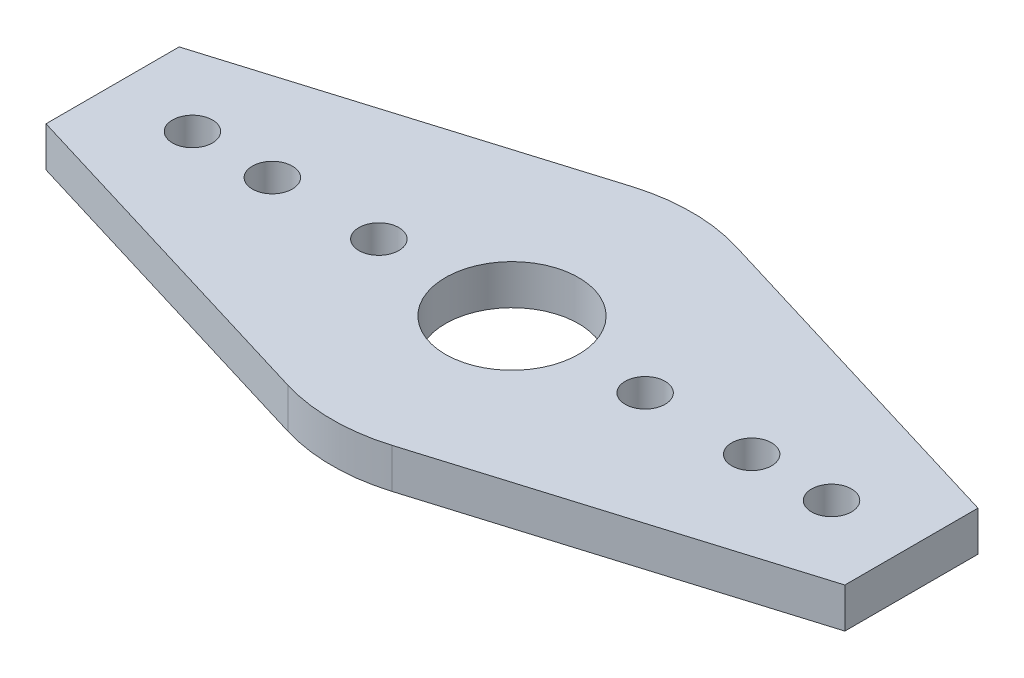
ISO-10303-21;
HEADER;
FILE_DESCRIPTION(('STEP AP214'),'2;1');
FILE_NAME('part.step','',(''),(''),'','','');
FILE_SCHEMA(('AUTOMOTIVE_DESIGN { 1 0 10303 214 1 1 1 1 }'));
ENDSEC;
DATA;
#1=APPLICATION_CONTEXT('core data for automotive mechanical design processes');
#2=APPLICATION_PROTOCOL_DEFINITION('international standard','automotive_design',2000,#1);
#3=PRODUCT_CONTEXT('',#1,'mechanical');
#4=PRODUCT('Part','Part','',(#3));
#5=PRODUCT_RELATED_PRODUCT_CATEGORY('part','',(#4));
#6=PRODUCT_DEFINITION_FORMATION('','',#4);
#7=PRODUCT_DEFINITION_CONTEXT('part definition',#1,'design');
#8=PRODUCT_DEFINITION('design','',#6,#7);
#9=PRODUCT_DEFINITION_SHAPE('','',#8);
#10=(LENGTH_UNIT() NAMED_UNIT(*) SI_UNIT(.MILLI.,.METRE.));
#11=(NAMED_UNIT(*) PLANE_ANGLE_UNIT() SI_UNIT($,.RADIAN.));
#12=(NAMED_UNIT(*) SI_UNIT($,.STERADIAN.) SOLID_ANGLE_UNIT());
#13=UNCERTAINTY_MEASURE_WITH_UNIT(LENGTH_MEASURE(1.E-05),#10,'distance_accuracy_value','');
#14=(GEOMETRIC_REPRESENTATION_CONTEXT(3) GLOBAL_UNCERTAINTY_ASSIGNED_CONTEXT((#13)) GLOBAL_UNIT_ASSIGNED_CONTEXT((#10,
#11,#12)) REPRESENTATION_CONTEXT('',''));
#15=CARTESIAN_POINT('',(0.,0.,0.));
#16=DIRECTION('',(0.,0.,1.));
#17=DIRECTION('',(1.,0.,0.));
#18=AXIS2_PLACEMENT_3D('',#15,#16,#17);
#19=CARTESIAN_POINT('',(-0.169164408184982,3.,-0.557162952153057));
#20=DIRECTION('',(-0.29052194513609,0.,-0.956868329183458));
#21=DIRECTION('',(-0.956868329183458,0.,0.29052194513609));
#22=AXIS2_PLACEMENT_3D('',#19,#20,#21);
#23=PLANE('',#22);
#24=DIRECTION('',(0.956868329183458,0.,-0.29052194513609));
#25=VECTOR('',#24,1.);
#26=CARTESIAN_POINT('',(-0.169164408184982,0.,-0.557162952153057));
#27=LINE('',#26,#25);
#28=CARTESIAN_POINT('',(-30.,0.,8.5));
#29=VERTEX_POINT('',#28);
#30=CARTESIAN_POINT('',(-3.92204625933722,0.,0.582277556023319));
#31=VERTEX_POINT('',#30);
#32=EDGE_CURVE('E158',#29,#31,#27,.T.);
#33=ORIENTED_EDGE('',*,*,#32,.F.);
#34=DIRECTION('',(0.,-1.,0.));
#35=VECTOR('',#34,1.);
#36=CARTESIAN_POINT('',(-30.,3.,8.5));
#37=LINE('',#36,#35);
#38=CARTESIAN_POINT('',(-30.,3.,8.5));
#39=VERTEX_POINT('',#38);
#40=EDGE_CURVE('E11',#39,#29,#37,.T.);
#41=ORIENTED_EDGE('',*,*,#40,.F.);
#42=DIRECTION('',(0.956868329183458,0.,-0.29052194513609));
#43=VECTOR('',#42,1.);
#44=CARTESIAN_POINT('',(-0.169164408184982,3.,-0.557162952153057));
#45=LINE('',#44,#43);
#46=CARTESIAN_POINT('',(-3.92204625933722,3.,0.582277556023319));
#47=VERTEX_POINT('',#46);
#48=EDGE_CURVE('E271',#39,#47,#45,.T.);
#49=ORIENTED_EDGE('',*,*,#48,.T.);
#50=DIRECTION('',(0.,-1.,0.));
#51=VECTOR('',#50,1.);
#52=CARTESIAN_POINT('',(-3.92204625933722,3.,0.582277556023319));
#53=LINE('',#52,#51);
#54=EDGE_CURVE('E86',#47,#31,#53,.T.);
#55=ORIENTED_EDGE('',*,*,#54,.T.);
#56=EDGE_LOOP('',(#33,#41,#49,#55));
#57=FACE_BOUND('',#56,.T.);
#58=ADVANCED_FACE('F35',(#57),#23,.T.);
#59=CARTESIAN_POINT('',(-30.,3.,0.));
#60=DIRECTION('',(-1.,0.,0.));
#61=DIRECTION('',(0.,0.,1.));
#62=AXIS2_PLACEMENT_3D('',#59,#60,#61);
#63=PLANE('',#62);
#64=DIRECTION('',(0.,0.,-1.));
#65=VECTOR('',#64,1.);
#66=CARTESIAN_POINT('',(-30.,0.,0.));
#67=LINE('',#66,#65);
#68=CARTESIAN_POINT('',(-30.,0.,18.5));
#69=VERTEX_POINT('',#68);
#70=EDGE_CURVE('E152',#69,#29,#67,.T.);
#71=ORIENTED_EDGE('',*,*,#70,.F.);
#72=DIRECTION('',(0.,-1.,0.));
#73=VECTOR('',#72,1.);
#74=CARTESIAN_POINT('',(-30.,3.,18.5));
#75=LINE('',#74,#73);
#76=CARTESIAN_POINT('',(-30.,3.,18.5));
#77=VERTEX_POINT('',#76);
#78=EDGE_CURVE('E44',#77,#69,#75,.T.);
#79=ORIENTED_EDGE('',*,*,#78,.F.);
#80=DIRECTION('',(0.,0.,-1.));
#81=VECTOR('',#80,1.);
#82=CARTESIAN_POINT('',(-30.,3.,0.));
#83=LINE('',#82,#81);
#84=EDGE_CURVE('E273',#77,#39,#83,.T.);
#85=ORIENTED_EDGE('',*,*,#84,.T.);
#86=ORIENTED_EDGE('',*,*,#40,.T.);
#87=EDGE_LOOP('',(#71,#79,#85,#86));
#88=FACE_BOUND('',#87,.T.);
#89=ADVANCED_FACE('F157',(#88),#63,.T.);
#90=CARTESIAN_POINT('',(-7.67492811048945,3.,25.2782819358003));
#91=DIRECTION('',(0.29052194513609,0.,-0.956868329183458));
#92=DIRECTION('',(-0.956868329183458,0.,-0.29052194513609));
#93=AXIS2_PLACEMENT_3D('',#90,#91,#92);
#94=PLANE('',#93);
#95=DIRECTION('',(0.956868329183458,0.,0.29052194513609));
#96=VECTOR('',#95,1.);
#97=CARTESIAN_POINT('',(-7.67492811048945,0.,25.2782819358003));
#98=LINE('',#97,#96);
#99=CARTESIAN_POINT('',(-3.92204625933722,0.,26.4177224439767));
#100=VERTEX_POINT('',#99);
#101=EDGE_CURVE('E142',#69,#100,#98,.T.);
#102=ORIENTED_EDGE('',*,*,#101,.T.);
#103=DIRECTION('',(0.,-1.,0.));
#104=VECTOR('',#103,1.);
#105=CARTESIAN_POINT('',(-3.92204625933722,3.,26.4177224439767));
#106=LINE('',#105,#104);
#107=CARTESIAN_POINT('',(-3.92204625933722,3.,26.4177224439767));
#108=VERTEX_POINT('',#107);
#109=EDGE_CURVE('E134',#108,#100,#106,.T.);
#110=ORIENTED_EDGE('',*,*,#109,.F.);
#111=DIRECTION('',(0.956868329183458,0.,0.29052194513609));
#112=VECTOR('',#111,1.);
#113=CARTESIAN_POINT('',(-7.67492811048945,3.,25.2782819358003));
#114=LINE('',#113,#112);
#115=EDGE_CURVE('E144',#77,#108,#114,.T.);
#116=ORIENTED_EDGE('',*,*,#115,.F.);
#117=ORIENTED_EDGE('',*,*,#78,.T.);
#118=EDGE_LOOP('',(#102,#110,#116,#117));
#119=FACE_BOUND('',#118,.T.);
#120=ADVANCED_FACE('F140',(#119),#94,.F.);
#121=CARTESIAN_POINT('',(0.,3.,13.5));
#122=DIRECTION('',(0.,-1.,0.));
#123=DIRECTION('',(0.,0.,-1.));
#124=AXIS2_PLACEMENT_3D('',#121,#122,#123);
#125=CYLINDRICAL_SURFACE('',#124,13.5);
#126=CARTESIAN_POINT('',(0.,0.,13.5));
#127=DIRECTION('',(0.,1.,0.));
#128=DIRECTION('',(0.,0.,1.));
#129=AXIS2_PLACEMENT_3D('',#126,#127,#128);
#130=CIRCLE('',#129,13.5);
#131=CARTESIAN_POINT('',(3.92204625933722,0.,26.4177224439767));
#132=VERTEX_POINT('',#131);
#133=EDGE_CURVE('E155',#100,#132,#130,.T.);
#134=ORIENTED_EDGE('',*,*,#133,.T.);
#135=DIRECTION('',(0.,-1.,0.));
#136=VECTOR('',#135,1.);
#137=CARTESIAN_POINT('',(3.92204625933722,3.,26.4177224439767));
#138=LINE('',#137,#136);
#139=CARTESIAN_POINT('',(3.92204625933722,3.,26.4177224439767));
#140=VERTEX_POINT('',#139);
#141=EDGE_CURVE('E128',#140,#132,#138,.T.);
#142=ORIENTED_EDGE('',*,*,#141,.F.);
#143=CARTESIAN_POINT('',(0.,3.,13.5));
#144=DIRECTION('',(0.,1.,0.));
#145=DIRECTION('',(0.,0.,1.));
#146=AXIS2_PLACEMENT_3D('',#143,#144,#145);
#147=CIRCLE('',#146,13.5);
#148=EDGE_CURVE('E280',#108,#140,#147,.T.);
#149=ORIENTED_EDGE('',*,*,#148,.F.);
#150=ORIENTED_EDGE('',*,*,#109,.T.);
#151=EDGE_LOOP('',(#134,#142,#149,#150));
#152=FACE_BOUND('',#151,.T.);
#153=ADVANCED_FACE('F229',(#152),#125,.T.);
#154=CARTESIAN_POINT('',(7.67492811048946,3.,25.2782819358003));
#155=DIRECTION('',(0.290521945136091,0.,0.956868329183458));
#156=DIRECTION('',(0.956868329183458,0.,-0.290521945136091));
#157=AXIS2_PLACEMENT_3D('',#154,#155,#156);
#158=PLANE('',#157);
#159=DIRECTION('',(-0.956868329183458,0.,0.290521945136091));
#160=VECTOR('',#159,1.);
#161=CARTESIAN_POINT('',(7.67492811048946,0.,25.2782819358003));
#162=LINE('',#161,#160);
#163=CARTESIAN_POINT('',(30.,0.,18.5));
#164=VERTEX_POINT('',#163);
#165=EDGE_CURVE('E165',#164,#132,#162,.T.);
#166=ORIENTED_EDGE('',*,*,#165,.F.);
#167=DIRECTION('',(0.,-1.,0.));
#168=VECTOR('',#167,1.);
#169=CARTESIAN_POINT('',(30.,3.,18.5));
#170=LINE('',#169,#168);
#171=CARTESIAN_POINT('',(30.,3.,18.5));
#172=VERTEX_POINT('',#171);
#173=EDGE_CURVE('E126',#172,#164,#170,.T.);
#174=ORIENTED_EDGE('',*,*,#173,.F.);
#175=DIRECTION('',(-0.956868329183458,0.,0.290521945136091));
#176=VECTOR('',#175,1.);
#177=CARTESIAN_POINT('',(7.67492811048946,3.,25.2782819358003));
#178=LINE('',#177,#176);
#179=EDGE_CURVE('E120',#172,#140,#178,.T.);
#180=ORIENTED_EDGE('',*,*,#179,.T.);
#181=ORIENTED_EDGE('',*,*,#141,.T.);
#182=EDGE_LOOP('',(#166,#174,#180,#181));
#183=FACE_BOUND('',#182,.T.);
#184=ADVANCED_FACE('F232',(#183),#158,.T.);
#185=CARTESIAN_POINT('',(30.,3.,0.));
#186=DIRECTION('',(-1.,0.,0.));
#187=DIRECTION('',(0.,0.,1.));
#188=AXIS2_PLACEMENT_3D('',#185,#186,#187);
#189=PLANE('',#188);
#190=DIRECTION('',(0.,0.,-1.));
#191=VECTOR('',#190,1.);
#192=CARTESIAN_POINT('',(30.,0.,0.));
#193=LINE('',#192,#191);
#194=CARTESIAN_POINT('',(30.,0.,8.49999999999999));
#195=VERTEX_POINT('',#194);
#196=EDGE_CURVE('E125',#164,#195,#193,.T.);
#197=ORIENTED_EDGE('',*,*,#196,.T.);
#198=DIRECTION('',(0.,-1.,0.));
#199=VECTOR('',#198,1.);
#200=CARTESIAN_POINT('',(30.,3.,8.49999999999999));
#201=LINE('',#200,#199);
#202=CARTESIAN_POINT('',(30.,3.,8.49999999999999));
#203=VERTEX_POINT('',#202);
#204=EDGE_CURVE('E110',#203,#195,#201,.T.);
#205=ORIENTED_EDGE('',*,*,#204,.F.);
#206=DIRECTION('',(0.,0.,-1.));
#207=VECTOR('',#206,1.);
#208=CARTESIAN_POINT('',(30.,3.,0.));
#209=LINE('',#208,#207);
#210=EDGE_CURVE('E113',#172,#203,#209,.T.);
#211=ORIENTED_EDGE('',*,*,#210,.F.);
#212=ORIENTED_EDGE('',*,*,#173,.T.);
#213=EDGE_LOOP('',(#197,#205,#211,#212));
#214=FACE_BOUND('',#213,.T.);
#215=ADVANCED_FACE('F123',(#214),#189,.F.);
#216=CARTESIAN_POINT('',(0.169164408184981,3.,-0.557162952153054));
#217=DIRECTION('',(-0.29052194513609,0.,0.956868329183458));
#218=DIRECTION('',(0.956868329183458,0.,0.29052194513609));
#219=AXIS2_PLACEMENT_3D('',#216,#217,#218);
#220=PLANE('',#219);
#221=DIRECTION('',(-0.956868329183458,0.,-0.29052194513609));
#222=VECTOR('',#221,1.);
#223=CARTESIAN_POINT('',(0.169164408184981,0.,-0.557162952153054));
#224=LINE('',#223,#222);
#225=CARTESIAN_POINT('',(3.92204625933722,0.,0.58227755602332));
#226=VERTEX_POINT('',#225);
#227=EDGE_CURVE('E168',#195,#226,#224,.T.);
#228=ORIENTED_EDGE('',*,*,#227,.T.);
#229=DIRECTION('',(0.,-1.,0.));
#230=VECTOR('',#229,1.);
#231=CARTESIAN_POINT('',(3.92204625933722,3.,0.58227755602332));
#232=LINE('',#231,#230);
#233=CARTESIAN_POINT('',(3.92204625933722,3.,0.58227755602332));
#234=VERTEX_POINT('',#233);
#235=EDGE_CURVE('E112',#234,#226,#232,.T.);
#236=ORIENTED_EDGE('',*,*,#235,.F.);
#237=DIRECTION('',(-0.956868329183458,0.,-0.29052194513609));
#238=VECTOR('',#237,1.);
#239=CARTESIAN_POINT('',(0.169164408184981,3.,-0.557162952153054));
#240=LINE('',#239,#238);
#241=EDGE_CURVE('E105',#203,#234,#240,.T.);
#242=ORIENTED_EDGE('',*,*,#241,.F.);
#243=ORIENTED_EDGE('',*,*,#204,.T.);
#244=EDGE_LOOP('',(#228,#236,#242,#243));
#245=FACE_BOUND('',#244,.T.);
#246=ADVANCED_FACE('F108',(#245),#220,.F.);
#247=CARTESIAN_POINT('',(-10.,3.,13.5));
#248=DIRECTION('',(0.,-1.,0.));
#249=DIRECTION('',(0.,0.,-1.));
#250=AXIS2_PLACEMENT_3D('',#247,#248,#249);
#251=CYLINDRICAL_SURFACE('',#250,1.5);
#252=CARTESIAN_POINT('',(-10.,3.,13.5));
#253=DIRECTION('',(0.,1.,0.));
#254=DIRECTION('',(0.,0.,1.));
#255=AXIS2_PLACEMENT_3D('',#252,#253,#254);
#256=CIRCLE('',#255,1.5);
#257=CARTESIAN_POINT('',(-10.,3.,15.));
#258=VERTEX_POINT('',#257);
#259=EDGE_CURVE('E182',#258,#258,#256,.T.);
#260=ORIENTED_EDGE('',*,*,#259,.T.);
#261=EDGE_LOOP('',(#260));
#262=FACE_BOUND('',#261,.T.);
#263=CARTESIAN_POINT('',(-10.,0.,13.5));
#264=DIRECTION('',(0.,1.,0.));
#265=DIRECTION('',(0.,0.,1.));
#266=AXIS2_PLACEMENT_3D('',#263,#264,#265);
#267=CIRCLE('',#266,1.5);
#268=CARTESIAN_POINT('',(-10.,0.,15.));
#269=VERTEX_POINT('',#268);
#270=EDGE_CURVE('E174',#269,#269,#267,.T.);
#271=ORIENTED_EDGE('',*,*,#270,.F.);
#272=EDGE_LOOP('',(#271));
#273=FACE_BOUND('',#272,.T.);
#274=ADVANCED_FACE('F240',(#262,#273),#251,.F.);
#275=CARTESIAN_POINT('',(10.,3.,13.5));
#276=DIRECTION('',(0.,-1.,0.));
#277=DIRECTION('',(0.,0.,-1.));
#278=AXIS2_PLACEMENT_3D('',#275,#276,#277);
#279=CYLINDRICAL_SURFACE('',#278,1.5);
#280=CARTESIAN_POINT('',(10.,3.,13.5));
#281=DIRECTION('',(0.,1.,0.));
#282=DIRECTION('',(0.,0.,1.));
#283=AXIS2_PLACEMENT_3D('',#280,#281,#282);
#284=CIRCLE('',#283,1.5);
#285=CARTESIAN_POINT('',(10.,3.,15.));
#286=VERTEX_POINT('',#285);
#287=EDGE_CURVE('E187',#286,#286,#284,.F.);
#288=ORIENTED_EDGE('',*,*,#287,.F.);
#289=EDGE_LOOP('',(#288));
#290=FACE_BOUND('',#289,.T.);
#291=CARTESIAN_POINT('',(10.,0.,13.5));
#292=DIRECTION('',(0.,1.,0.));
#293=DIRECTION('',(0.,0.,1.));
#294=AXIS2_PLACEMENT_3D('',#291,#292,#293);
#295=CIRCLE('',#294,1.5);
#296=CARTESIAN_POINT('',(10.,0.,15.));
#297=VERTEX_POINT('',#296);
#298=EDGE_CURVE('E171',#297,#297,#295,.F.);
#299=ORIENTED_EDGE('',*,*,#298,.T.);
#300=EDGE_LOOP('',(#299));
#301=FACE_BOUND('',#300,.T.);
#302=ADVANCED_FACE('F216',(#290,#301),#279,.F.);
#303=CARTESIAN_POINT('',(0.,3.,13.5));
#304=DIRECTION('',(0.,-1.,0.));
#305=DIRECTION('',(0.,0.,-1.));
#306=AXIS2_PLACEMENT_3D('',#303,#304,#305);
#307=CYLINDRICAL_SURFACE('',#306,13.5);
#308=CARTESIAN_POINT('',(0.,0.,13.5));
#309=DIRECTION('',(0.,1.,0.));
#310=DIRECTION('',(0.,0.,1.));
#311=AXIS2_PLACEMENT_3D('',#308,#309,#310);
#312=CIRCLE('',#311,13.5);
#313=EDGE_CURVE('E79',#226,#31,#312,.T.);
#314=ORIENTED_EDGE('',*,*,#313,.T.);
#315=ORIENTED_EDGE('',*,*,#54,.F.);
#316=CARTESIAN_POINT('',(0.,3.,13.5));
#317=DIRECTION('',(0.,1.,0.));
#318=DIRECTION('',(0.,0.,1.));
#319=AXIS2_PLACEMENT_3D('',#316,#317,#318);
#320=CIRCLE('',#319,13.5);
#321=EDGE_CURVE('E52',#234,#47,#320,.T.);
#322=ORIENTED_EDGE('',*,*,#321,.F.);
#323=ORIENTED_EDGE('',*,*,#235,.T.);
#324=EDGE_LOOP('',(#314,#315,#322,#323));
#325=FACE_BOUND('',#324,.T.);
#326=ADVANCED_FACE('F206',(#325),#307,.T.);
#327=CARTESIAN_POINT('',(-24.,3.,13.5));
#328=DIRECTION('',(0.,-1.,0.));
#329=DIRECTION('',(0.,0.,-1.));
#330=AXIS2_PLACEMENT_3D('',#327,#328,#329);
#331=CYLINDRICAL_SURFACE('',#330,1.5);
#332=CARTESIAN_POINT('',(-24.,3.,13.5));
#333=DIRECTION('',(0.,1.,0.));
#334=DIRECTION('',(0.,0.,1.));
#335=AXIS2_PLACEMENT_3D('',#332,#333,#334);
#336=CIRCLE('',#335,1.5);
#337=CARTESIAN_POINT('',(-24.,3.,15.));
#338=VERTEX_POINT('',#337);
#339=EDGE_CURVE('E270',#338,#338,#336,.T.);
#340=ORIENTED_EDGE('',*,*,#339,.T.);
#341=EDGE_LOOP('',(#340));
#342=FACE_BOUND('',#341,.T.);
#343=CARTESIAN_POINT('',(-24.,0.,13.5));
#344=DIRECTION('',(0.,1.,0.));
#345=DIRECTION('',(0.,0.,1.));
#346=AXIS2_PLACEMENT_3D('',#343,#344,#345);
#347=CIRCLE('',#346,1.5);
#348=CARTESIAN_POINT('',(-24.,0.,15.));
#349=VERTEX_POINT('',#348);
#350=EDGE_CURVE('E160',#349,#349,#347,.T.);
#351=ORIENTED_EDGE('',*,*,#350,.F.);
#352=EDGE_LOOP('',(#351));
#353=FACE_BOUND('',#352,.T.);
#354=ADVANCED_FACE('F203',(#342,#353),#331,.F.);
#355=CARTESIAN_POINT('',(0.,3.,13.5));
#356=DIRECTION('',(0.,-1.,0.));
#357=DIRECTION('',(0.,0.,-1.));
#358=AXIS2_PLACEMENT_3D('',#355,#356,#357);
#359=CYLINDRICAL_SURFACE('',#358,5.);
#360=CARTESIAN_POINT('',(0.,3.,13.5));
#361=DIRECTION('',(0.,1.,0.));
#362=DIRECTION('',(0.,0.,1.));
#363=AXIS2_PLACEMENT_3D('',#360,#361,#362);
#364=CIRCLE('',#363,5.);
#365=CARTESIAN_POINT('',(0.,3.,18.5));
#366=VERTEX_POINT('',#365);
#367=EDGE_CURVE('E268',#366,#366,#364,.T.);
#368=ORIENTED_EDGE('',*,*,#367,.T.);
#369=EDGE_LOOP('',(#368));
#370=FACE_BOUND('',#369,.T.);
#371=CARTESIAN_POINT('',(0.,0.,13.5));
#372=DIRECTION('',(0.,1.,0.));
#373=DIRECTION('',(0.,0.,1.));
#374=AXIS2_PLACEMENT_3D('',#371,#372,#373);
#375=CIRCLE('',#374,5.);
#376=CARTESIAN_POINT('',(0.,0.,18.5));
#377=VERTEX_POINT('',#376);
#378=EDGE_CURVE('E197',#377,#377,#375,.T.);
#379=ORIENTED_EDGE('',*,*,#378,.F.);
#380=EDGE_LOOP('',(#379));
#381=FACE_BOUND('',#380,.T.);
#382=ADVANCED_FACE('F205',(#370,#381),#359,.F.);
#383=CARTESIAN_POINT('',(18.,3.,13.5));
#384=DIRECTION('',(0.,-1.,0.));
#385=DIRECTION('',(0.,0.,-1.));
#386=AXIS2_PLACEMENT_3D('',#383,#384,#385);
#387=CYLINDRICAL_SURFACE('',#386,1.5);
#388=CARTESIAN_POINT('',(18.,3.,13.5));
#389=DIRECTION('',(0.,1.,0.));
#390=DIRECTION('',(0.,0.,1.));
#391=AXIS2_PLACEMENT_3D('',#388,#389,#390);
#392=CIRCLE('',#391,1.5);
#393=CARTESIAN_POINT('',(18.,3.,15.));
#394=VERTEX_POINT('',#393);
#395=EDGE_CURVE('E264',#394,#394,#392,.F.);
#396=ORIENTED_EDGE('',*,*,#395,.F.);
#397=EDGE_LOOP('',(#396));
#398=FACE_BOUND('',#397,.T.);
#399=CARTESIAN_POINT('',(18.,0.,13.5));
#400=DIRECTION('',(0.,1.,0.));
#401=DIRECTION('',(0.,0.,1.));
#402=AXIS2_PLACEMENT_3D('',#399,#400,#401);
#403=CIRCLE('',#402,1.5);
#404=CARTESIAN_POINT('',(18.,0.,15.));
#405=VERTEX_POINT('',#404);
#406=EDGE_CURVE('E194',#405,#405,#403,.F.);
#407=ORIENTED_EDGE('',*,*,#406,.T.);
#408=EDGE_LOOP('',(#407));
#409=FACE_BOUND('',#408,.T.);
#410=ADVANCED_FACE('F213',(#398,#409),#387,.F.);
#411=CARTESIAN_POINT('',(24.,3.,13.5));
#412=DIRECTION('',(0.,-1.,0.));
#413=DIRECTION('',(0.,0.,-1.));
#414=AXIS2_PLACEMENT_3D('',#411,#412,#413);
#415=CYLINDRICAL_SURFACE('',#414,1.5);
#416=CARTESIAN_POINT('',(24.,3.,13.5));
#417=DIRECTION('',(0.,1.,0.));
#418=DIRECTION('',(0.,0.,1.));
#419=AXIS2_PLACEMENT_3D('',#416,#417,#418);
#420=CIRCLE('',#419,1.5);
#421=CARTESIAN_POINT('',(24.,3.,15.));
#422=VERTEX_POINT('',#421);
#423=EDGE_CURVE('E179',#422,#422,#420,.F.);
#424=ORIENTED_EDGE('',*,*,#423,.F.);
#425=EDGE_LOOP('',(#424));
#426=FACE_BOUND('',#425,.T.);
#427=CARTESIAN_POINT('',(24.,0.,13.5));
#428=DIRECTION('',(0.,1.,0.));
#429=DIRECTION('',(0.,0.,1.));
#430=AXIS2_PLACEMENT_3D('',#427,#428,#429);
#431=CIRCLE('',#430,1.5);
#432=CARTESIAN_POINT('',(24.,0.,15.));
#433=VERTEX_POINT('',#432);
#434=EDGE_CURVE('E191',#433,#433,#431,.F.);
#435=ORIENTED_EDGE('',*,*,#434,.T.);
#436=EDGE_LOOP('',(#435));
#437=FACE_BOUND('',#436,.T.);
#438=ADVANCED_FACE('F37',(#426,#437),#415,.F.);
#439=CARTESIAN_POINT('',(-18.,3.,13.5));
#440=DIRECTION('',(0.,-1.,0.));
#441=DIRECTION('',(0.,0.,-1.));
#442=AXIS2_PLACEMENT_3D('',#439,#440,#441);
#443=CYLINDRICAL_SURFACE('',#442,1.5);
#444=CARTESIAN_POINT('',(-18.,3.,13.5));
#445=DIRECTION('',(0.,1.,0.));
#446=DIRECTION('',(0.,0.,1.));
#447=AXIS2_PLACEMENT_3D('',#444,#445,#446);
#448=CIRCLE('',#447,1.5);
#449=CARTESIAN_POINT('',(-18.,3.,15.));
#450=VERTEX_POINT('',#449);
#451=EDGE_CURVE('E180',#450,#450,#448,.T.);
#452=ORIENTED_EDGE('',*,*,#451,.T.);
#453=EDGE_LOOP('',(#452));
#454=FACE_BOUND('',#453,.T.);
#455=CARTESIAN_POINT('',(-18.,0.,13.5));
#456=DIRECTION('',(0.,1.,0.));
#457=DIRECTION('',(0.,0.,1.));
#458=AXIS2_PLACEMENT_3D('',#455,#456,#457);
#459=CIRCLE('',#458,1.5);
#460=CARTESIAN_POINT('',(-18.,0.,15.));
#461=VERTEX_POINT('',#460);
#462=EDGE_CURVE('E177',#461,#461,#459,.T.);
#463=ORIENTED_EDGE('',*,*,#462,.F.);
#464=EDGE_LOOP('',(#463));
#465=FACE_BOUND('',#464,.T.);
#466=ADVANCED_FACE('F248',(#454,#465),#443,.F.);
#467=CARTESIAN_POINT('',(0.,3.,0.));
#468=DIRECTION('',(0.,1.,0.));
#469=DIRECTION('',(0.,0.,1.));
#470=AXIS2_PLACEMENT_3D('',#467,#468,#469);
#471=PLANE('',#470);
#472=ORIENTED_EDGE('',*,*,#423,.T.);
#473=EDGE_LOOP('',(#472));
#474=FACE_BOUND('',#473,.T.);
#475=ORIENTED_EDGE('',*,*,#395,.T.);
#476=EDGE_LOOP('',(#475));
#477=FACE_BOUND('',#476,.T.);
#478=ORIENTED_EDGE('',*,*,#367,.F.);
#479=EDGE_LOOP('',(#478));
#480=FACE_BOUND('',#479,.T.);
#481=ORIENTED_EDGE('',*,*,#339,.F.);
#482=EDGE_LOOP('',(#481));
#483=FACE_BOUND('',#482,.T.);
#484=ORIENTED_EDGE('',*,*,#48,.F.);
#485=ORIENTED_EDGE('',*,*,#84,.F.);
#486=ORIENTED_EDGE('',*,*,#115,.T.);
#487=ORIENTED_EDGE('',*,*,#148,.T.);
#488=ORIENTED_EDGE('',*,*,#179,.F.);
#489=ORIENTED_EDGE('',*,*,#210,.T.);
#490=ORIENTED_EDGE('',*,*,#241,.T.);
#491=ORIENTED_EDGE('',*,*,#321,.T.);
#492=EDGE_LOOP('',(#484,#485,#486,#487,#488,#489,#490,#491));
#493=FACE_BOUND('',#492,.T.);
#494=ORIENTED_EDGE('',*,*,#287,.T.);
#495=EDGE_LOOP('',(#494));
#496=FACE_BOUND('',#495,.T.);
#497=ORIENTED_EDGE('',*,*,#259,.F.);
#498=EDGE_LOOP('',(#497));
#499=FACE_BOUND('',#498,.T.);
#500=ORIENTED_EDGE('',*,*,#451,.F.);
#501=EDGE_LOOP('',(#500));
#502=FACE_BOUND('',#501,.T.);
#503=ADVANCED_FACE('F117',(#474,#477,#480,#483,#493,#496,#499,#502),#471,.T.);
#504=CARTESIAN_POINT('',(0.,0.,0.));
#505=DIRECTION('',(0.,1.,0.));
#506=DIRECTION('',(0.,0.,1.));
#507=AXIS2_PLACEMENT_3D('',#504,#505,#506);
#508=PLANE('',#507);
#509=ORIENTED_EDGE('',*,*,#434,.F.);
#510=EDGE_LOOP('',(#509));
#511=FACE_BOUND('',#510,.T.);
#512=ORIENTED_EDGE('',*,*,#406,.F.);
#513=EDGE_LOOP('',(#512));
#514=FACE_BOUND('',#513,.T.);
#515=ORIENTED_EDGE('',*,*,#378,.T.);
#516=EDGE_LOOP('',(#515));
#517=FACE_BOUND('',#516,.T.);
#518=ORIENTED_EDGE('',*,*,#350,.T.);
#519=EDGE_LOOP('',(#518));
#520=FACE_BOUND('',#519,.T.);
#521=ORIENTED_EDGE('',*,*,#32,.T.);
#522=ORIENTED_EDGE('',*,*,#313,.F.);
#523=ORIENTED_EDGE('',*,*,#227,.F.);
#524=ORIENTED_EDGE('',*,*,#196,.F.);
#525=ORIENTED_EDGE('',*,*,#165,.T.);
#526=ORIENTED_EDGE('',*,*,#133,.F.);
#527=ORIENTED_EDGE('',*,*,#101,.F.);
#528=ORIENTED_EDGE('',*,*,#70,.T.);
#529=EDGE_LOOP('',(#521,#522,#523,#524,#525,#526,#527,#528));
#530=FACE_BOUND('',#529,.T.);
#531=ORIENTED_EDGE('',*,*,#298,.F.);
#532=EDGE_LOOP('',(#531));
#533=FACE_BOUND('',#532,.T.);
#534=ORIENTED_EDGE('',*,*,#270,.T.);
#535=EDGE_LOOP('',(#534));
#536=FACE_BOUND('',#535,.T.);
#537=ORIENTED_EDGE('',*,*,#462,.T.);
#538=EDGE_LOOP('',(#537));
#539=FACE_BOUND('',#538,.T.);
#540=ADVANCED_FACE('F150',(#511,#514,#517,#520,#530,#533,#536,#539),#508,.F.);
#541=CLOSED_SHELL('',(#58,#89,#120,#153,#184,#215,#246,#274,#302,#326,#354,#382,#410,#438,#466,
#503,#540));
#542=MANIFOLD_SOLID_BREP('B2',#541);
#543=ADVANCED_BREP_SHAPE_REPRESENTATION('',(#18,#542),#14);
#544=SHAPE_DEFINITION_REPRESENTATION(#9,#543);
ENDSEC;
END-ISO-10303-21;
